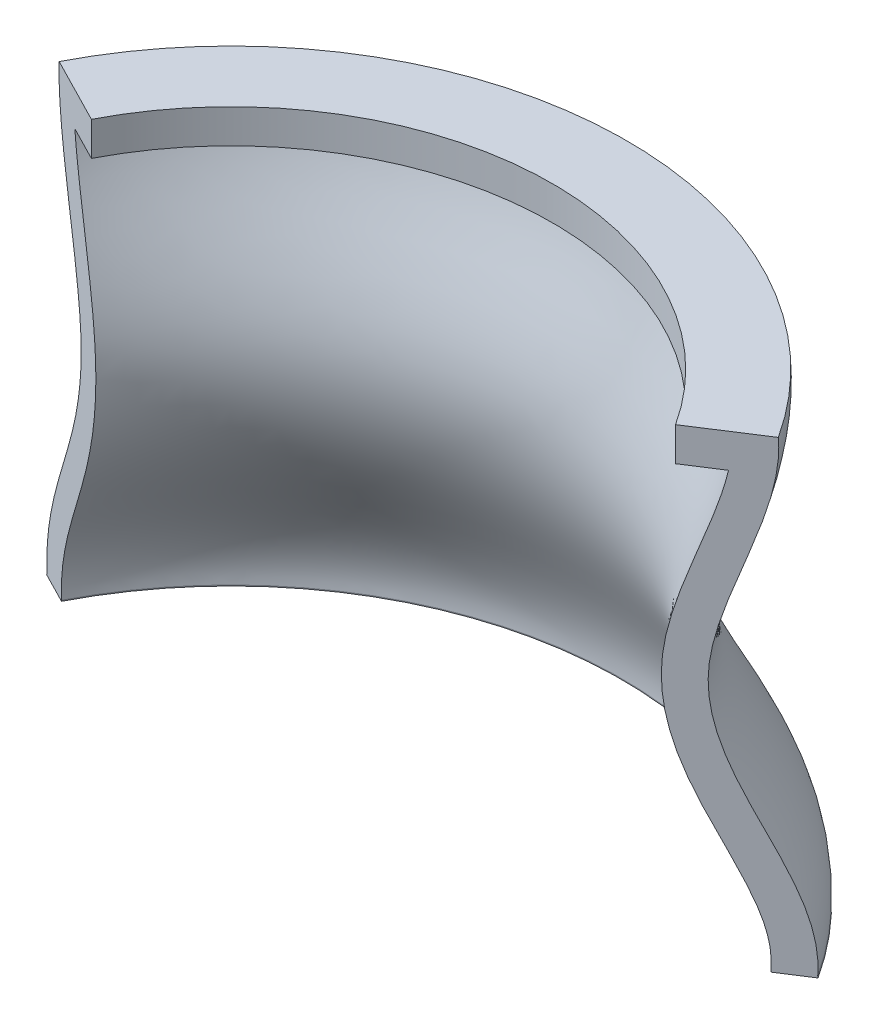
ISO-10303-21;
HEADER;
FILE_DESCRIPTION(('STEP AP214'),'2;1');
FILE_NAME('part.step','',(''),(''),'','','');
FILE_SCHEMA(('AUTOMOTIVE_DESIGN { 1 0 10303 214 1 1 1 1 }'));
ENDSEC;
DATA;
#1=APPLICATION_CONTEXT('core data for automotive mechanical design processes');
#2=APPLICATION_PROTOCOL_DEFINITION('international standard','automotive_design',2000,#1);
#3=PRODUCT_CONTEXT('',#1,'mechanical');
#4=PRODUCT('Part','Part','',(#3));
#5=PRODUCT_RELATED_PRODUCT_CATEGORY('part','',(#4));
#6=PRODUCT_DEFINITION_FORMATION('','',#4);
#7=PRODUCT_DEFINITION_CONTEXT('part definition',#1,'design');
#8=PRODUCT_DEFINITION('design','',#6,#7);
#9=PRODUCT_DEFINITION_SHAPE('','',#8);
#10=(LENGTH_UNIT() NAMED_UNIT(*) SI_UNIT(.MILLI.,.METRE.));
#11=(NAMED_UNIT(*) PLANE_ANGLE_UNIT() SI_UNIT($,.RADIAN.));
#12=(NAMED_UNIT(*) SI_UNIT($,.STERADIAN.) SOLID_ANGLE_UNIT());
#13=UNCERTAINTY_MEASURE_WITH_UNIT(LENGTH_MEASURE(1.E-05),#10,'distance_accuracy_value','');
#14=(GEOMETRIC_REPRESENTATION_CONTEXT(3) GLOBAL_UNCERTAINTY_ASSIGNED_CONTEXT((#13)) GLOBAL_UNIT_ASSIGNED_CONTEXT((#10,
#11,#12)) REPRESENTATION_CONTEXT('',''));
#15=CARTESIAN_POINT('',(0.,0.,0.));
#16=DIRECTION('',(0.,0.,1.));
#17=DIRECTION('',(1.,0.,0.));
#18=AXIS2_PLACEMENT_3D('',#15,#16,#17);
#19=CARTESIAN_POINT('',(0.745225859525673,-249.139394389774,8.26973830905769));
#20=DIRECTION('',(-0.542378393115804,0.,-0.840134321808792));
#21=DIRECTION('',(-0.840134321808792,0.,0.542378393115804));
#22=AXIS2_PLACEMENT_3D('',#19,#20,#21);
#23=PLANE('',#22);
#24=DIRECTION('',(-0.840134321808792,0.,0.542378393115804));
#25=VECTOR('',#24,1.);
#26=CARTESIAN_POINT('',(0.745225859525673,136.691433037476,8.26973830905769));
#27=LINE('',#26,#25);
#28=CARTESIAN_POINT('',(98.9977571909952,136.691433037479,-55.1606545219238));
#29=VERTEX_POINT('',#28);
#30=CARTESIAN_POINT('',(80.557523717464,136.691433037476,-43.2559103156399));
#31=VERTEX_POINT('',#30);
#32=EDGE_CURVE('E115',#29,#31,#27,.T.);
#33=ORIENTED_EDGE('',*,*,#32,.T.);
#34=DIRECTION('',(0.,1.,0.));
#35=VECTOR('',#34,1.);
#36=CARTESIAN_POINT('',(80.5575237174639,-0.309566962524016,-43.2559103156399));
#37=LINE('',#36,#35);
#38=CARTESIAN_POINT('',(80.557523717464,126.691433037476,-43.2559103156399));
#39=VERTEX_POINT('',#38);
#40=EDGE_CURVE('E101',#39,#31,#37,.T.);
#41=ORIENTED_EDGE('',*,*,#40,.F.);
#42=DIRECTION('',(-0.840134321808792,0.,0.542378393115804));
#43=VECTOR('',#42,1.);
#44=CARTESIAN_POINT('',(0.745225859525673,126.691433037476,8.26973830905769));
#45=LINE('',#44,#43);
#46=CARTESIAN_POINT('',(90.0632839932266,126.691433037476,-49.3926896970751));
#47=VERTEX_POINT('',#46);
#48=EDGE_CURVE('E214',#47,#39,#45,.T.);
#49=ORIENTED_EDGE('',*,*,#48,.F.);
#50=CARTESIAN_POINT('',(97.6500739454705,-0.00626043381479245,-54.2906099895659));
#51=CARTESIAN_POINT('',(97.6529723465695,0.050992226669759,-54.2924811547948));
#52=CARTESIAN_POINT('',(97.6558692963534,0.108244968614973,-54.2943513830761));
#53=CARTESIAN_POINT('',(97.6616631850123,0.222750236839855,-54.298091832596));
#54=CARTESIAN_POINT('',(97.6645601238873,0.280002763119524,-54.2999620538347));
#55=CARTESIAN_POINT('',(97.6703571898607,0.394513294641576,-54.3037045545822));
#56=CARTESIAN_POINT('',(97.6732573172451,0.451771299867904,-54.3055768342758));
#57=CARTESIAN_POINT('',(97.6790459707793,0.566288177798032,-54.309313904076));
#58=CARTESIAN_POINT('',(97.6819344968852,0.623547050504287,-54.3111786941544));
#59=CARTESIAN_POINT('',(97.6906665943295,0.795343624830428,-54.3168160081618));
#60=CARTESIAN_POINT('',(97.6965755200439,0.909877658183604,-54.3206307239171));
#61=CARTESIAN_POINT('',(97.7043319736219,1.08174848521094,-54.3256381765574));
#62=CARTESIAN_POINT('',(97.7067329204786,1.13904888515215,-54.3271881926254));
#63=CARTESIAN_POINT('',(97.7112219706133,1.25366709113484,-54.3300862575365));
#64=CARTESIAN_POINT('',(97.7133100716362,1.31098489729882,-54.3314343049238));
#65=CARTESIAN_POINT('',(97.7190695275018,1.48246612137103,-54.3351525251375));
#66=CARTESIAN_POINT('',(97.7222583166751,1.59665313448834,-54.3372111606473));
#67=CARTESIAN_POINT('',(97.7273647344901,1.82507091288732,-54.3405077890758));
#68=CARTESIAN_POINT('',(97.7292823176255,1.93930167958881,-54.3417457526164));
#69=CARTESIAN_POINT('',(97.7318536076438,2.16777237667633,-54.3434057397306));
#70=CARTESIAN_POINT('',(97.7325074390331,2.28201230505061,-54.3438278436836));
#71=CARTESIAN_POINT('',(97.7325643268168,2.51049013772023,-54.3438645696022));
#72=CARTESIAN_POINT('',(97.731967401428,2.62472804202081,-54.3434792033282));
#73=CARTESIAN_POINT('',(97.7283276769775,2.96666220947244,-54.341129450619));
#74=CARTESIAN_POINT('',(97.7234442348151,3.19433449227308,-54.3379767720006));
#75=CARTESIAN_POINT('',(97.7088778089557,3.64946836089107,-54.32857290116));
#76=CARTESIAN_POINT('',(97.6991945845693,3.87692993556913,-54.3223215535522));
#77=CARTESIAN_POINT('',(97.6751853534089,4.33114243440764,-54.3068215461383));
#78=CARTESIAN_POINT('',(97.6608667653355,4.55789391342217,-54.2975776757364));
#79=CARTESIAN_POINT('',(97.6277352402899,5.01092117793659,-54.2761884492172));
#80=CARTESIAN_POINT('',(97.6089223926932,5.23719697280594,-54.2640431507994));
#81=CARTESIAN_POINT('',(97.5459938520619,5.9150402196691,-54.2234174081501));
#82=CARTESIAN_POINT('',(97.4953800753674,6.36577270591949,-54.1907418964367));
#83=CARTESIAN_POINT('',(97.3797810627051,7.25220800335587,-54.116112869737));
#84=CARTESIAN_POINT('',(97.3152173044396,7.6879898918938,-54.0744314545721));
#85=CARTESIAN_POINT('',(97.1722500190924,8.5566792729806,-53.9821338725286));
#86=CARTESIAN_POINT('',(97.0938353224117,8.98958415089695,-53.9315104947207));
#87=CARTESIAN_POINT('',(96.9244351818875,9.852253721158,-53.8221482491534));
#88=CARTESIAN_POINT('',(96.8334393904096,10.2820155188637,-53.7634027011132));
#89=CARTESIAN_POINT('',(96.640129549994,11.1381414190644,-53.6386047040591));
#90=CARTESIAN_POINT('',(96.5378097072509,11.5645036615132,-53.5725485146496));
#91=CARTESIAN_POINT('',(96.3230767363544,12.4135515504553,-53.4339200588413));
#92=CARTESIAN_POINT('',(96.2106644962917,12.8362375168629,-53.361348365781));
#93=CARTESIAN_POINT('',(95.8630792581119,14.0876348747868,-53.1369524352007));
#94=CARTESIAN_POINT('',(95.6148840211636,14.9112397207704,-52.9767212313318));
#95=CARTESIAN_POINT('',(95.090987587738,16.5455660869207,-52.6385013796435));
#96=CARTESIAN_POINT('',(94.8152927904313,17.3562905536938,-52.4605168630347));
#97=CARTESIAN_POINT('',(94.2423487814763,18.9673154003877,-52.0906326161284));
#98=CARTESIAN_POINT('',(93.9450883068052,19.7676100720405,-51.8987256145887));
#99=CARTESIAN_POINT('',(93.3341790322162,21.3597148657106,-51.5043315491519));
#100=CARTESIAN_POINT('',(93.0205220896604,22.1515205322271,-51.3018392284873));
#101=CARTESIAN_POINT('',(92.3813672501433,23.7282794978847,-50.8892102407046));
#102=CARTESIAN_POINT('',(92.0558695780595,24.5132329268119,-50.6790737187641));
#103=CARTESIAN_POINT('',(91.3909274871383,26.0923529868729,-50.2497968597823));
#104=CARTESIAN_POINT('',(91.0513376472443,26.8864324727524,-50.0305626410402));
#105=CARTESIAN_POINT('',(90.3675736912737,28.4711786967947,-49.5891346621054));
#106=CARTESIAN_POINT('',(90.0234024348371,29.261847190237,-49.3669427480543));
#107=CARTESIAN_POINT('',(89.3335771200953,30.8419329181993,-48.9216016448188));
#108=CARTESIAN_POINT('',(88.9879235871686,31.6313504789219,-48.6984527948112));
#109=CARTESIAN_POINT('',(88.2979951727613,33.2109465539751,-48.2530451319443));
#110=CARTESIAN_POINT('',(87.9537201629274,34.0011249885429,-48.0307862362219));
#111=CARTESIAN_POINT('',(87.2692387332724,35.5841447914238,-47.588895066802));
#112=CARTESIAN_POINT('',(86.929032990209,36.3769865753486,-47.3692632300093));
#113=CARTESIAN_POINT('',(86.1722517806457,38.1630869045638,-46.8806963833419));
#114=CARTESIAN_POINT('',(85.7575650885196,39.1574852391578,-46.612980738494));
#115=CARTESIAN_POINT('',(84.9438213426653,41.1555167620316,-46.0876397140561));
#116=CARTESIAN_POINT('',(84.5447664663298,42.1591512129569,-45.8300157401589));
#117=CARTESIAN_POINT('',(83.7674331824598,44.1777891928056,-45.3281807758246));
#118=CARTESIAN_POINT('',(83.389154384336,45.1927925075625,-45.083969533229));
#119=CARTESIAN_POINT('',(82.6583912852814,47.2362332810939,-44.6121995970119));
#120=CARTESIAN_POINT('',(82.3059133322319,48.2646739730584,-44.3846450014894));
#121=CARTESIAN_POINT('',(81.635643476377,50.3247991014784,-43.9519286156264));
#122=CARTESIAN_POINT('',(81.317519080651,51.3563294898614,-43.7465521727342));
#123=CARTESIAN_POINT('',(80.7166264329103,53.4340871100825,-43.3586246946435));
#124=CARTESIAN_POINT('',(80.4338620153338,54.4803159221588,-43.1760761349021));
#125=CARTESIAN_POINT('',(79.9086897669904,56.5868526967909,-42.8370326358195));
#126=CARTESIAN_POINT('',(79.6662732549411,57.6471575775802,-42.6805320919696));
#127=CARTESIAN_POINT('',(79.2263613585989,59.7811407733943,-42.3965314253417));
#128=CARTESIAN_POINT('',(79.0288709659511,60.8548205605112,-42.2690345250967));
#129=CARTESIAN_POINT('',(78.737994625523,62.6706517182577,-42.0812490269669));
#130=CARTESIAN_POINT('',(78.6314629487749,63.4098434381794,-42.0124737393127));
#131=CARTESIAN_POINT('',(78.4424801657721,64.8927490330594,-41.890469227045));
#132=CARTESIAN_POINT('',(78.3600336358989,65.6364637400547,-41.8372429568763));
#133=CARTESIAN_POINT('',(78.2202989084025,67.1270997214922,-41.7470322667586));
#134=CARTESIAN_POINT('',(78.163005850192,67.8740203482378,-41.7100447088857));
#135=CARTESIAN_POINT('',(78.0744121230822,69.3697373198263,-41.6528498983624));
#136=CARTESIAN_POINT('',(78.0431007334387,70.118532763013,-41.6326357245568));
#137=CARTESIAN_POINT('',(78.0070713654121,71.6166785404882,-41.6093756931214));
#138=CARTESIAN_POINT('',(78.0023397188302,72.3660283913619,-41.6063210115029));
#139=CARTESIAN_POINT('',(78.015470087199,73.4908633669651,-41.614797784695));
#140=CARTESIAN_POINT('',(78.0232471753082,73.8665506169505,-41.6198185586859));
#141=CARTESIAN_POINT('',(78.0456050791866,74.6176434464617,-41.6342524934321));
#142=CARTESIAN_POINT('',(78.060185869957,74.9930490270174,-41.6436656380486));
#143=CARTESIAN_POINT('',(78.0961801576338,75.7434476174287,-41.6669030221247));
#144=CARTESIAN_POINT('',(78.1175946178443,76.1184405616346,-41.6807278834796));
#145=CARTESIAN_POINT('',(78.1672067568217,76.8677892804022,-41.7127567525772));
#146=CARTESIAN_POINT('',(78.1954044470656,77.2421450538847,-41.7309607677293));
#147=CARTESIAN_POINT('',(78.2582503897009,77.9902309606631,-41.7715331863242));
#148=CARTESIAN_POINT('',(78.2929010985036,78.3639608008456,-41.7939031755901));
#149=CARTESIAN_POINT('',(78.3683332991725,79.110537496885,-41.842601097727));
#150=CARTESIAN_POINT('',(78.4091148043398,79.4833843508242,-41.868929039185));
#151=CARTESIAN_POINT('',(78.5402031883033,80.6006927925859,-41.9535577767626));
#152=CARTESIAN_POINT('',(78.6392368362119,81.3437226337301,-42.0174924469966));
#153=CARTESIAN_POINT('',(78.8580432814978,82.8252418760472,-42.1587506781114));
#154=CARTESIAN_POINT('',(78.977812214926,83.5637320966601,-42.2360717444834));
#155=CARTESIAN_POINT('',(79.2652319618521,85.2047342876377,-42.4216257165577));
#156=CARTESIAN_POINT('',(79.4375670066023,86.1060821560101,-42.5328826932371));
#157=CARTESIAN_POINT('',(79.805673624607,87.9015715335771,-42.7705269255771));
#158=CARTESIAN_POINT('',(80.0014369523751,88.795715460608,-42.8969088580725));
#159=CARTESIAN_POINT('',(80.4125371665499,90.5775544122617,-43.1623091253698));
#160=CARTESIAN_POINT('',(80.627873763162,91.4652495321532,-43.3013272730845));
#161=CARTESIAN_POINT('',(81.0744808647508,93.2348507231825,-43.5896502659987));
#162=CARTESIAN_POINT('',(81.3057503919158,94.1167571459437,-43.7389544799372));
#163=CARTESIAN_POINT('',(81.7813645691623,95.8776102287981,-44.0460040153528));
#164=CARTESIAN_POINT('',(82.0257360244444,96.7565465810112,-44.2037666418741));
#165=CARTESIAN_POINT('',(82.5238805215691,98.5105179509239,-44.5253614212759));
#166=CARTESIAN_POINT('',(82.777652590643,99.3855533618499,-44.6891929461512));
#167=CARTESIAN_POINT('',(83.2915945894062,101.133031222346,-45.0209863608563));
#168=CARTESIAN_POINT('',(83.5517650678698,102.005473442262,-45.1889486049667));
#169=CARTESIAN_POINT('',(84.0755546977968,103.749049561602,-45.5270995058833));
#170=CARTESIAN_POINT('',(84.3391744228889,104.620183215843,-45.6972885330156));
#171=CARTESIAN_POINT('',(84.8668540072619,106.362276790706,-46.0379507314556));
#172=CARTESIAN_POINT('',(85.1309138736253,107.233236708273,-46.2084239073355));
#173=CARTESIAN_POINT('',(85.6564009011121,108.976216936723,-46.5476706232153));
#174=CARTESIAN_POINT('',(85.9178282462333,109.848237168653,-46.7164442820013));
#175=CARTESIAN_POINT('',(86.43476583322,111.594485503086,-47.0501716045173));
#176=CARTESIAN_POINT('',(86.6902777716165,112.468712890765,-47.2151263635027));
#177=CARTESIAN_POINT('',(87.1918419304453,114.220636915393,-47.5389288263331));
#178=CARTESIAN_POINT('',(87.437897885186,115.098332028682,-47.6977789409928));
#179=CARTESIAN_POINT('',(87.9161316944769,116.856828440095,-48.0065196724254));
#180=CARTESIAN_POINT('',(88.1483405639575,117.737617727538,-48.1564303119823));
#181=CARTESIAN_POINT('',(88.5949729196666,119.505755367552,-48.4447696085861));
#182=CARTESIAN_POINT('',(88.809394194446,120.393104520788,-48.5831968379538));
#183=CARTESIAN_POINT('',(89.1136266420929,121.730199393826,-48.7796048429656));
#184=CARTESIAN_POINT('',(89.2121817516245,122.177130948856,-48.8432305758437));
#185=CARTESIAN_POINT('',(89.4026348533489,123.072989573305,-48.966184304308));
#186=CARTESIAN_POINT('',(89.494533079451,123.521916572018,-49.0255124509026));
#187=CARTESIAN_POINT('',(89.6710167110061,124.422983296087,-49.1394476943622));
#188=CARTESIAN_POINT('',(89.7555834819998,124.875128219444,-49.1940427610937));
#189=CARTESIAN_POINT('',(89.9161327983945,125.781627365753,-49.2976910444474));
#190=CARTESIAN_POINT('',(89.9921142555959,126.235981861175,-49.3467435585439));
#191=CARTESIAN_POINT('',(90.0632839932266,126.691433037476,-49.3926896970751));
#192=B_SPLINE_CURVE_WITH_KNOTS('',3,(#50,#51,#52,#53,#54,#55,#56,#57,#58,#59,#60,#61,#62,#63,
#64,#65,#66,#67,#68,#69,#70,#71,#72,#73,#74,#75,#76,#77,#78,#79,#80,#81,#82,#83,#84,#85,#86,#87,
#88,#89,#90,#91,#92,#93,#94,#95,#96,#97,#98,#99,#100,#101,#102,#103,#104,#105,#106,#107,#108,
#109,#110,#111,#112,#113,#114,#115,#116,#117,#118,#119,#120,#121,#122,#123,#124,#125,#126,#127,
#128,#129,#130,#131,#132,#133,#134,#135,#136,#137,#138,#139,#140,#141,#142,#143,#144,#145,#146,
#147,#148,#149,#150,#151,#152,#153,#154,#155,#156,#157,#158,#159,#160,#161,#162,#163,#164,#165,
#166,#167,#168,#169,#170,#171,#172,#173,#174,#175,#176,#177,#178,#179,#180,#181,#182,#183,#184,
#185,#186,#187,#188,#189,#190,#191),.UNSPECIFIED.,.F.,.F.,(4,2,2,2,2,2,2,2,2,2,2,2,2,2,2,2,2,2,
2,2,2,2,2,2,2,2,2,2,2,2,2,2,2,2,2,2,2,2,2,2,2,2,2,2,2,2,2,2,2,2,2,2,2,2,2,2,2,2,2,2,2,2,2,2,2,2,
2,2,2,2,4),(0.,0.172069481748386,0.344138315328275,0.516224105252337,0.688310543451353,
1.032554416554,1.20466731631694,1.37678145665585,1.71952035976686,2.06227153147332,
2.40498893317287,2.74770134337536,3.43085995597681,4.11405282966193,4.79615764380616,
5.47824889434355,6.84198338198694,8.16917219964607,9.49743620900451,10.8267992539083,
12.1568456224069,13.4867750666083,16.1107265684423,18.7340688927741,21.3587913022965,
23.9848297905993,26.6108184315594,29.283889286879,31.9553633576754,34.6259580705434,
37.296298057951,39.9670761403357,43.2974339779905,46.6282540713645,49.9590115240326,
53.290585720386,56.5863023345853,59.8823760271535,63.1777396149427,66.4734691649189,
68.722933602427,70.9728251796131,73.2222818024005,75.4708097758979,77.7181813746851,
78.8455133715751,79.9728412263349,81.1003280644552,82.2278168102524,83.3557356273726,
84.4836568916161,86.7401010135971,88.9961251066847,91.7687517406593,94.540405414172,
97.3120180582761,100.083460758406,102.860807648258,105.637867938718,108.415167246603,
111.192934458445,113.970746808263,116.748363638542,119.525173727946,122.300875702505,
125.070107071223,127.83968221126,129.225834551546,130.611938161613,132.001467433958,
133.39117263381),.UNSPECIFIED.);
#193=CARTESIAN_POINT('',(97.6500739454705,-0.00626043381479245,-54.2906099895659));
#194=VERTEX_POINT('',#193);
#195=EDGE_CURVE('E206',#194,#47,#192,.T.);
#196=ORIENTED_EDGE('',*,*,#195,.F.);
#197=CARTESIAN_POINT('',(0.422385769287787,-13.3893943897737,8.4781591351496));
#198=DIRECTION('',(-0.542378393115804,0.,-0.840134321808792));
#199=DIRECTION('',(-0.840134321808792,0.,0.542378393115804));
#200=AXIS2_PLACEMENT_3D('',#197,#198,#199);
#201=CIRCLE('',#200,116.5);
#202=CARTESIAN_POINT('',(97.6791084914496,-0.308566962524024,-54.3093542665036));
#203=VERTEX_POINT('',#202);
#204=EDGE_CURVE('E212',#203,#194,#201,.F.);
#205=ORIENTED_EDGE('',*,*,#204,.F.);
#206=DIRECTION('',(0.840134321808792,0.,-0.542378393115804));
#207=VECTOR('',#206,1.);
#208=CARTESIAN_POINT('',(0.745225859525659,-0.308566962524031,8.2697383090577));
#209=LINE('',#208,#207);
#210=CARTESIAN_POINT('',(106.129653796851,-0.308566962524023,-59.7649023434171));
#211=VERTEX_POINT('',#210);
#212=EDGE_CURVE('E121',#203,#211,#209,.T.);
#213=ORIENTED_EDGE('',*,*,#212,.T.);
#214=CARTESIAN_POINT('',(0.422385769287787,-13.3893943897737,8.4781591351496));
#215=DIRECTION('',(-0.542378393115804,0.,-0.840134321808792));
#216=DIRECTION('',(-0.840134321808792,0.,0.542378393115804));
#217=AXIS2_PLACEMENT_3D('',#214,#215,#216);
#218=CIRCLE('',#217,126.5);
#219=CARTESIAN_POINT('',(106.079685655918,0.251403416725651,-59.7326436446801));
#220=VERTEX_POINT('',#219);
#221=EDGE_CURVE('E145',#211,#220,#218,.F.);
#222=ORIENTED_EDGE('',*,*,#221,.T.);
#223=CARTESIAN_POINT('',(106.079685655918,0.251403416725651,-59.7326436446801));
#224=CARTESIAN_POINT('',(107.382812457229,26.0009316272872,-60.5739231903123));
#225=CARTESIAN_POINT('',(69.2176983011643,62.0053854720913,-35.9350853858046));
#226=CARTESIAN_POINT('',(100.39909294893,117.34806292094,-56.0653363291946));
#227=CARTESIAN_POINT('',(98.9701417174655,137.101403416726,-55.1428263773411));
#228=B_SPLINE_CURVE_WITH_KNOTS('',3,(#223,#224,#225,#226,#227),.UNSPECIFIED.,.F.,.F.,(4,1,4),
(0.,0.593387476514039,1.),.UNSPECIFIED.);
#229=EDGE_CURVE('E120',#220,#29,#228,.T.);
#230=ORIENTED_EDGE('',*,*,#229,.T.);
#231=EDGE_LOOP('',(#33,#41,#49,#196,#205,#213,#222,#230));
#232=FACE_BOUND('',#231,.T.);
#233=ADVANCED_FACE('F38',(#232),#23,.F.);
#234=CARTESIAN_POINT('',(-111.470105782793,-249.139394389774,-49.2880256775196));
#235=DIRECTION('',(0.456388468719719,0.,-0.889780627806467));
#236=DIRECTION('',(-0.889780627806467,0.,-0.456388468719719));
#237=AXIS2_PLACEMENT_3D('',#234,#235,#236);
#238=PLANE('',#237);
#239=DIRECTION('',(-0.889780627806467,0.,-0.456388468719719));
#240=VECTOR('',#239,1.);
#241=CARTESIAN_POINT('',(-111.470105782793,126.691433037476,-49.2880256775196));
#242=LINE('',#241,#240);
#243=CARTESIAN_POINT('',(-83.7834437249025,126.691433037476,-35.086914857978));
#244=VERTEX_POINT('',#243);
#245=CARTESIAN_POINT('',(-93.8509307045257,126.691433037476,-40.250755048355));
#246=VERTEX_POINT('',#245);
#247=EDGE_CURVE('E126',#244,#246,#242,.T.);
#248=ORIENTED_EDGE('',*,*,#247,.F.);
#249=DIRECTION('',(0.,1.,0.));
#250=VECTOR('',#249,1.);
#251=CARTESIAN_POINT('',(-83.7834437249025,-0.309566962524016,-35.086914857978));
#252=LINE('',#251,#250);
#253=CARTESIAN_POINT('',(-83.7834437249025,136.691433037476,-35.086914857978));
#254=VERTEX_POINT('',#253);
#255=EDGE_CURVE('E53',#254,#244,#252,.F.);
#256=ORIENTED_EDGE('',*,*,#255,.F.);
#257=DIRECTION('',(-0.889780627806467,0.,-0.456388468719719));
#258=VECTOR('',#257,1.);
#259=CARTESIAN_POINT('',(-111.470105782793,136.691433037476,-49.2880256775196));
#260=LINE('',#259,#258);
#261=CARTESIAN_POINT('',(-103.313371369864,136.691433037476,-45.1042533946284));
#262=VERTEX_POINT('',#261);
#263=EDGE_CURVE('E11',#254,#262,#260,.T.);
#264=ORIENTED_EDGE('',*,*,#263,.T.);
#265=CARTESIAN_POINT('',(-110.813794328453,0.251403416719608,-48.9513887916552));
#266=CARTESIAN_POINT('',(-112.193927187311,26.000931627281,-49.659289933127));
#267=CARTESIAN_POINT('',(-71.7735106508517,62.0053854720874,-28.9267504378969));
#268=CARTESIAN_POINT('',(-104.797516676268,117.348062920934,-45.8655048565964));
#269=CARTESIAN_POINT('',(-103.284124006988,137.10140341672,-45.0892517653063));
#270=B_SPLINE_CURVE_WITH_KNOTS('',3,(#265,#266,#267,#268,#269),.UNSPECIFIED.,.F.,.F.,(4,1,4),
(0.,0.593387476514039,1.),.UNSPECIFIED.);
#271=CARTESIAN_POINT('',(-110.813794328453,0.251403416719608,-48.9513887916552));
#272=VERTEX_POINT('',#271);
#273=EDGE_CURVE('E132',#262,#272,#270,.F.);
#274=ORIENTED_EDGE('',*,*,#273,.T.);
#275=CARTESIAN_POINT('',(1.08714363472618,-13.3893943897737,8.44511561552255));
#276=DIRECTION('',(0.456388468719719,0.,-0.889780627806467));
#277=DIRECTION('',(-0.889780627806467,0.,-0.456388468719719));
#278=AXIS2_PLACEMENT_3D('',#275,#276,#277);
#279=CIRCLE('',#278,126.5);
#280=CARTESIAN_POINT('',(-110.866715251518,-0.308566962524001,-48.9785331217139));
#281=VERTEX_POINT('',#280);
#282=EDGE_CURVE('E136',#272,#281,#279,.F.);
#283=ORIENTED_EDGE('',*,*,#282,.T.);
#284=DIRECTION('',(0.889780627806467,0.,0.456388468719719));
#285=VECTOR('',#284,1.);
#286=CARTESIAN_POINT('',(-111.470105782793,-0.308566962523999,-49.2880256775196));
#287=LINE('',#286,#285);
#288=CARTESIAN_POINT('',(-101.916799350737,-0.308566962524,-44.3879202386262));
#289=VERTEX_POINT('',#288);
#290=EDGE_CURVE('E46',#281,#289,#287,.T.);
#291=ORIENTED_EDGE('',*,*,#290,.T.);
#292=CARTESIAN_POINT('',(1.08714363472618,-13.3893943897737,8.44511561552255));
#293=DIRECTION('',(0.456388468719719,0.,-0.889780627806467));
#294=DIRECTION('',(-0.889780627806467,0.,-0.456388468719719));
#295=AXIS2_PLACEMENT_3D('',#292,#293,#294);
#296=CIRCLE('',#295,116.5);
#297=CARTESIAN_POINT('',(-101.88604907965,-0.00626043382030513,-44.3721477339262));
#298=VERTEX_POINT('',#297);
#299=EDGE_CURVE('E61',#298,#289,#296,.F.);
#300=ORIENTED_EDGE('',*,*,#299,.F.);
#301=CARTESIAN_POINT('',(-93.8509307045257,126.691433037476,-40.250755048355));
#302=CARTESIAN_POINT('',(-93.7668854227947,126.183648215492,-40.207646335675));
#303=CARTESIAN_POINT('',(-93.6765189003933,125.677232048323,-40.1612953166784));
#304=CARTESIAN_POINT('',(-93.4846413228614,124.667154406378,-40.0628769975391));
#305=CARTESIAN_POINT('',(-93.3831321191838,124.163492488516,-40.0108106470482));
#306=CARTESIAN_POINT('',(-93.1707359789729,123.160178658433,-39.9018678962582));
#307=CARTESIAN_POINT('',(-93.059876091351,122.660519467452,-39.8450053699534));
#308=CARTESIAN_POINT('',(-92.8297741585983,121.663629731152,-39.7269809204918));
#309=CARTESIAN_POINT('',(-92.7105317269779,121.166399298946,-39.6658187990959));
#310=CARTESIAN_POINT('',(-92.3422068298699,119.679147565428,-39.4768966866906));
#311=CARTESIAN_POINT('',(-92.0822982226099,118.692510303434,-39.3435837244081));
#312=CARTESIAN_POINT('',(-91.5412778449906,116.726808119775,-39.0660822212606));
#313=CARTESIAN_POINT('',(-91.2601681168181,115.747742478769,-38.921894727879));
#314=CARTESIAN_POINT('',(-90.6772530075087,113.775833353922,-38.6229044758805));
#315=CARTESIAN_POINT('',(-90.375147408228,112.783102609551,-38.4679477286345));
#316=CARTESIAN_POINT('',(-89.7609780540985,110.801101852433,-38.1529264724887));
#317=CARTESIAN_POINT('',(-89.4489101870527,109.81183346082,-37.9928598543508));
#318=CARTESIAN_POINT('',(-88.8199613667477,107.834940992615,-37.6702578780527));
#319=CARTESIAN_POINT('',(-88.5030791408247,106.847317430176,-37.5077218671148));
#320=CARTESIAN_POINT('',(-87.8693267727348,104.872035745205,-37.1826560432689));
#321=CARTESIAN_POINT('',(-87.5524566311288,103.884377622463,-37.0201262306486));
#322=CARTESIAN_POINT('',(-86.8925204855549,101.810391018564,-36.6816301592363));
#323=CARTESIAN_POINT('',(-86.5499277747608,100.723871088137,-36.5059066631434));
#324=CARTESIAN_POINT('',(-85.8764342393989,98.546422786159,-36.1604567020062));
#325=CARTESIAN_POINT('',(-85.5455315992301,97.4554951287694,-35.9907293056992));
#326=CARTESIAN_POINT('',(-84.9016402691134,95.2667692703305,-35.6604629805059));
#327=CARTESIAN_POINT('',(-84.588654026171,94.1689701533899,-35.4999253067435));
#328=CARTESIAN_POINT('',(-83.9871715267013,91.9638988081433,-35.1914114233031));
#329=CARTESIAN_POINT('',(-83.698695029995,90.8566197139707,-35.0434453488809));
#330=CARTESIAN_POINT('',(-83.1575401816134,88.6468346813108,-34.7658748726591));
#331=CARTESIAN_POINT('',(-82.9044361715915,87.5444616286369,-34.6360521411332));
#332=CARTESIAN_POINT('',(-82.4373560211984,85.3292137425133,-34.3964762412479));
#333=CARTESIAN_POINT('',(-82.2233783145835,84.216339331314,-34.2867222695269));
#334=CARTESIAN_POINT('',(-81.843251275195,81.9813366078867,-34.0917465732666));
#335=CARTESIAN_POINT('',(-81.6770543966932,80.8592186458063,-34.0065004614554));
#336=CARTESIAN_POINT('',(-81.4013689863122,78.6068258680666,-33.8650952225008));
#337=CARTESIAN_POINT('',(-81.291837497706,77.4765578917823,-33.8089140618873));
#338=CARTESIAN_POINT('',(-81.1561408831128,75.4676705350852,-33.7393122204791));
#339=CARTESIAN_POINT('',(-81.1166945345797,74.5901771039809,-33.7190793023407));
#340=CARTESIAN_POINT('',(-81.0771593694951,72.833596787439,-33.6988008281981));
#341=CARTESIAN_POINT('',(-81.0770918937858,71.9545092961663,-33.6987662183913));
#342=CARTESIAN_POINT('',(-81.1157359160768,70.1971718781334,-33.7185876053797));
#343=CARTESIAN_POINT('',(-81.1544587198303,69.3189222702796,-33.7384494011497));
#344=CARTESIAN_POINT('',(-81.2696268241157,67.5656668403511,-33.797521708545));
#345=CARTESIAN_POINT('',(-81.3460681366561,66.690660685197,-33.8367301746399));
#346=CARTESIAN_POINT('',(-81.5356113128567,64.941634386963,-33.9339511269051));
#347=CARTESIAN_POINT('',(-81.6488795621368,64.0676371352678,-33.9920489559969));
#348=CARTESIAN_POINT('',(-81.9100769109271,62.3263549445044,-34.1260229427558));
#349=CARTESIAN_POINT('',(-82.0580015820516,61.4590691624613,-34.2018968290043));
#350=CARTESIAN_POINT('',(-82.3863378255807,59.7323048403488,-34.3703078628328));
#351=CARTESIAN_POINT('',(-82.5667504605452,58.8728265565996,-34.4628455554235));
#352=CARTESIAN_POINT('',(-82.9576144723881,57.1626983961283,-34.663328486011));
#353=CARTESIAN_POINT('',(-83.1680617107355,56.312047320381,-34.7712716012623));
#354=CARTESIAN_POINT('',(-83.5940822258011,54.7043065597516,-34.9897870919775));
#355=CARTESIAN_POINT('',(-83.8070542859123,53.9463415848269,-35.0990252450196));
#356=CARTESIAN_POINT('',(-84.2532783593845,52.438135445357,-35.327903594619));
#357=CARTESIAN_POINT('',(-84.4865272833383,51.6878931235924,-35.4475422065499));
#358=CARTESIAN_POINT('',(-84.9713463079043,50.19492616415,-35.6962167734185));
#359=CARTESIAN_POINT('',(-85.2229168331706,49.4522017011743,-35.8252529461708));
#360=CARTESIAN_POINT('',(-85.7423629103969,47.9740327459962,-36.0916885060821));
#361=CARTESIAN_POINT('',(-86.0102380190993,47.2385880565168,-36.2290876658842));
#362=CARTESIAN_POINT('',(-86.5609729733764,45.7727103518445,-36.5115719935916));
#363=CARTESIAN_POINT('',(-86.8438679885412,45.0422940706801,-36.6566752007695));
#364=CARTESIAN_POINT('',(-87.4220133323205,43.5877394008821,-36.9532189328974));
#365=CARTESIAN_POINT('',(-87.7172628287023,42.8636005933346,-37.1046590309766));
#366=CARTESIAN_POINT('',(-88.31813650737,41.4208123326336,-37.4128606365535));
#367=CARTESIAN_POINT('',(-88.6237604792345,40.7021627685057,-37.5696220361213));
#368=CARTESIAN_POINT('',(-89.2433660460799,39.2695454635641,-37.8874316478679));
#369=CARTESIAN_POINT('',(-89.5573466528076,38.5555771814804,-38.0484793531493));
#370=CARTESIAN_POINT('',(-90.2271460177557,37.0516847596047,-38.3920344913093));
#371=CARTESIAN_POINT('',(-90.5837199110273,36.262186475866,-38.574929249916));
#372=CARTESIAN_POINT('',(-91.3019737000096,34.6862219730195,-38.9433377504629));
#373=CARTESIAN_POINT('',(-91.66365317143,33.8997555087925,-39.1288512747748));
#374=CARTESIAN_POINT('',(-92.3893307542927,32.3280589014186,-39.5010676059434));
#375=CARTESIAN_POINT('',(-92.7533291399005,31.5428289186814,-39.6877705534255));
#376=CARTESIAN_POINT('',(-93.4806969755983,29.9717168866826,-40.0608538532367));
#377=CARTESIAN_POINT('',(-93.844066218214,29.1858347156918,-40.2472340991475));
#378=CARTESIAN_POINT('',(-94.5670049179558,27.6113978666685,-40.6180455956472));
#379=CARTESIAN_POINT('',(-94.9265725453805,26.822842123261,-40.8024759077412));
#380=CARTESIAN_POINT('',(-95.6336712968997,25.251436297375,-41.165162739028));
#381=CARTESIAN_POINT('',(-95.9812971577375,24.4686402922999,-41.3434678508242));
#382=CARTESIAN_POINT('',(-96.6653368455754,22.8968724594342,-41.6943271704359));
#383=CARTESIAN_POINT('',(-97.0017508618452,22.1079007361752,-41.8668814753321));
#384=CARTESIAN_POINT('',(-97.6588063833449,20.5220313958455,-42.2039000099571));
#385=CARTESIAN_POINT('',(-97.9794540226771,19.7251370085996,-42.3683673860048));
#386=CARTESIAN_POINT('',(-98.5998099950646,18.1213799139909,-42.6865618976082));
#387=CARTESIAN_POINT('',(-98.8995252924991,17.3145206281986,-42.8402926053505));
#388=CARTESIAN_POINT('',(-99.4721016498099,15.6883192866224,-43.1339798792377));
#389=CARTESIAN_POINT('',(-99.744951559502,14.8689722094774,-43.2739307262029));
#390=CARTESIAN_POINT('',(-100.138222601588,13.5980135856646,-43.4756482766645));
#391=CARTESIAN_POINT('',(-100.270883452431,13.1511749262425,-43.5436930066613));
#392=CARTESIAN_POINT('',(-100.524885581602,12.2533957436668,-43.673976403671));
#393=CARTESIAN_POINT('',(-100.646226037425,11.8024549250714,-43.7362146488025));
#394=CARTESIAN_POINT('',(-100.876067611854,10.8967411232276,-43.8541055546318));
#395=CARTESIAN_POINT('',(-100.984576519697,10.4419706462207,-43.9097622106045));
#396=CARTESIAN_POINT('',(-101.187193612794,9.52884302336228,-44.0136890684896));
#397=CARTESIAN_POINT('',(-101.281315713385,9.07048979982594,-44.0619664078909));
#398=CARTESIAN_POINT('',(-101.453571216526,8.15044920968577,-44.1503201243581));
#399=CARTESIAN_POINT('',(-101.531719930681,7.68876547939773,-44.19040435509));
#400=CARTESIAN_POINT('',(-101.672259474527,6.75009481994273,-44.2624902436855));
#401=CARTESIAN_POINT('',(-101.734192642976,6.27301999209029,-44.2942571568191));
#402=CARTESIAN_POINT('',(-101.811921114829,5.55528992460127,-44.3341258358351));
#403=CARTESIAN_POINT('',(-101.835304868497,5.31565077245144,-44.3461198882972));
#404=CARTESIAN_POINT('',(-101.876803515843,4.83578577514736,-44.3674054765921));
#405=CARTESIAN_POINT('',(-101.894918305676,4.59555991852391,-44.3766969591603));
#406=CARTESIAN_POINT('',(-101.925707973809,4.11423079761152,-44.39248967149));
#407=CARTESIAN_POINT('',(-101.93837292939,3.87312673219672,-44.3989858116661));
#408=CARTESIAN_POINT('',(-101.958034114193,3.39063344656056,-44.4090704749471));
#409=CARTESIAN_POINT('',(-101.965030626038,3.1492442411571,-44.4126591430162));
#410=CARTESIAN_POINT('',(-101.971163890188,2.78661412027086,-44.4158050319534));
#411=CARTESIAN_POINT('',(-101.972479717608,2.66541535172501,-44.416479949391));
#412=CARTESIAN_POINT('',(-101.973626637344,2.42300596301584,-44.4170682302837));
#413=CARTESIAN_POINT('',(-101.973457704594,2.30179534268698,-44.4169815808819));
#414=CARTESIAN_POINT('',(-101.971619244647,2.05937668374339,-44.4160385934828));
#415=CARTESIAN_POINT('',(-101.969949568267,1.93816864658335,-44.4151821789658));
#416=CARTESIAN_POINT('',(-101.965095074461,1.69579526455638,-44.4126922000595));
#417=CARTESIAN_POINT('',(-101.961910318764,1.57462991815137,-44.4110586673321));
#418=CARTESIAN_POINT('',(-101.955979506249,1.39261366227889,-44.4080166203854));
#419=CARTESIAN_POINT('',(-101.953803134769,1.33173868499417,-44.4069003105715));
#420=CARTESIAN_POINT('',(-101.949061093415,1.21000844590573,-44.4044680110535));
#421=CARTESIAN_POINT('',(-101.946495427489,1.14915318390834,-44.4031520233744));
#422=CARTESIAN_POINT('',(-101.940985378922,1.0274605429255,-44.4003257957074));
#423=CARTESIAN_POINT('',(-101.938040973705,0.966623165223003,-44.3988155441393));
#424=CARTESIAN_POINT('',(-101.933306078764,0.875387887581738,-44.3963869101769));
#425=CARTESIAN_POINT('',(-101.931674723472,0.844979438269635,-44.3955501514074));
#426=CARTESIAN_POINT('',(-101.928413888954,0.784162408317322,-44.3938775961435));
#427=CARTESIAN_POINT('',(-101.926784409728,0.753753827677003,-44.3930417996503));
#428=CARTESIAN_POINT('',(-101.921896154223,0.662541127796806,-44.3905345036098));
#429=CARTESIAN_POINT('',(-101.918636862885,0.601737035140401,-44.3888627398782));
#430=CARTESIAN_POINT('',(-101.912118648472,0.480128867213208,-44.3855194013049));
#431=CARTESIAN_POINT('',(-101.908859725396,0.419324791942431,-44.383847826463));
#432=CARTESIAN_POINT('',(-101.902342175208,0.297723876793116,-44.3805048285857));
#433=CARTESIAN_POINT('',(-101.899083548107,0.236927036914017,-44.3788334055558));
#434=CARTESIAN_POINT('',(-101.89256629196,0.115333320870809,-44.3754905584986));
#435=CARTESIAN_POINT('',(-101.889307662914,0.0545364447067008,-44.3738191344712));
#436=CARTESIAN_POINT('',(-101.88604907965,-0.00626043382031076,-44.3721477339262));
#437=B_SPLINE_CURVE_WITH_KNOTS('',3,(#301,#302,#303,#304,#305,#306,#307,#308,#309,#310,#311,
#312,#313,#314,#315,#316,#317,#318,#319,#320,#321,#322,#323,#324,#325,#326,#327,#328,#329,#330,
#331,#332,#333,#334,#335,#336,#337,#338,#339,#340,#341,#342,#343,#344,#345,#346,#347,#348,#349,
#350,#351,#352,#353,#354,#355,#356,#357,#358,#359,#360,#361,#362,#363,#364,#365,#366,#367,#368,
#369,#370,#371,#372,#373,#374,#375,#376,#377,#378,#379,#380,#381,#382,#383,#384,#385,#386,#387,
#388,#389,#390,#391,#392,#393,#394,#395,#396,#397,#398,#399,#400,#401,#402,#403,#404,#405,#406,
#407,#408,#409,#410,#411,#412,#413,#414,#415,#416,#417,#418,#419,#420,#421,#422,#423,#424,#425,
#426,#427,#428,#429,#430,#431,#432,#433,#434,#435,#436),.UNSPECIFIED.,.F.,.F.,(4,2,2,2,2,2,2,2,
2,2,2,2,2,2,2,2,2,2,2,2,2,2,2,2,2,2,2,2,2,2,2,2,2,2,2,2,2,2,2,2,2,2,2,2,2,2,2,2,2,2,2,2,2,2,2,2,
2,2,2,2,2,2,2,2,2,2,2,4),(0.,1.54936788731865,3.09847872232435,4.64325275919567,
6.18809806691024,9.27453148990197,12.3606679926098,15.5081203221535,18.6568890887498,
21.8065052300722,24.9562068146958,28.4143392702747,31.8719322559092,35.3299963552619,
38.7908224115222,42.2055491263621,45.6201391182071,49.031319466673,52.4399100745965,
55.0746385021728,57.7107947835128,60.3477196183878,62.9843657099736,65.6330937820024,
68.2814835848751,70.9299600224088,73.5780718725289,75.9622633702982,78.3460922443393,
80.7299763878441,83.1137957518094,85.5034667908792,87.8929771133252,90.2824389991689,
92.6716195526091,95.3277293760711,97.9836197525001,100.639830188571,103.296793392257,
105.954981955089,108.579531867364,111.204037451544,113.827513726474,116.450112947525,
119.073796101541,120.486808529532,121.899923542834,123.312176289602,124.72305430113,
126.132573478727,127.578393349343,128.301560663743,129.024742229996,129.749235005383,
130.473691655926,130.837305619675,131.200925722081,131.56458197477,131.92822341238,
132.110994385515,132.293763505268,132.476543525074,132.567934466489,132.659325511305,
132.842068483846,133.024811347312,133.207532479464,133.390253720667),.UNSPECIFIED.);
#438=EDGE_CURVE('E199',#246,#298,#437,.T.);
#439=ORIENTED_EDGE('',*,*,#438,.F.);
#440=EDGE_LOOP('',(#248,#256,#264,#274,#283,#291,#300,#439));
#441=FACE_BOUND('',#440,.T.);
#442=ADVANCED_FACE('F155',(#441),#238,.F.);
#443=CARTESIAN_POINT('',(-126.139046133486,-0.308566962523983,-130.618568454018));
#444=DIRECTION('',(0.,1.,0.));
#445=DIRECTION('',(0.,0.,1.));
#446=AXIS2_PLACEMENT_3D('',#443,#444,#445);
#447=PLANE('',#446);
#448=CARTESIAN_POINT('',(0.745225859531159,-0.308566962523999,8.26973830905769));
#449=DIRECTION('',(0.,1.,0.));
#450=DIRECTION('',(0.,0.,1.));
#451=AXIS2_PLACEMENT_3D('',#448,#449,#450);
#452=CIRCLE('',#451,115.379029419039);
#453=EDGE_CURVE('E163',#289,#203,#452,.F.);
#454=ORIENTED_EDGE('',*,*,#453,.F.);
#455=ORIENTED_EDGE('',*,*,#290,.F.);
#456=CARTESIAN_POINT('',(0.745225859531159,-0.308566962523999,8.26973830905769));
#457=DIRECTION('',(0.,1.,0.));
#458=DIRECTION('',(0.,0.,1.));
#459=AXIS2_PLACEMENT_3D('',#456,#457,#458);
#460=CIRCLE('',#459,125.437593967628);
#461=EDGE_CURVE('E124',#281,#211,#460,.F.);
#462=ORIENTED_EDGE('',*,*,#461,.T.);
#463=ORIENTED_EDGE('',*,*,#212,.F.);
#464=EDGE_LOOP('',(#454,#455,#462,#463));
#465=FACE_BOUND('',#464,.T.);
#466=ADVANCED_FACE('F160',(#465),#447,.F.);
#467=CARTESIAN_POINT('',(0.745225859531159,-13.3893943897737,8.26973830905769));
#468=DIRECTION('',(0.,-1.,0.));
#469=DIRECTION('',(1.,0.,0.));
#470=AXIS2_PLACEMENT_3D('',#467,#468,#469);
#471=DEGENERATE_TOROIDAL_SURFACE('',#470,0.384271993016906,126.5,.F.);
#472=ORIENTED_EDGE('',*,*,#461,.F.);
#473=ORIENTED_EDGE('',*,*,#282,.F.);
#474=CARTESIAN_POINT('',(0.745225859530778,0.251403416722708,8.26973830905769));
#475=DIRECTION('',(0.,-1.,0.));
#476=DIRECTION('',(1.,0.,0.));
#477=AXIS2_PLACEMENT_3D('',#474,#475,#476);
#478=CIRCLE('',#477,125.378117596249);
#479=EDGE_CURVE('E150',#272,#220,#478,.T.);
#480=ORIENTED_EDGE('',*,*,#479,.T.);
#481=ORIENTED_EDGE('',*,*,#221,.F.);
#482=EDGE_LOOP('',(#472,#473,#480,#481));
#483=FACE_BOUND('',#482,.T.);
#484=ADVANCED_FACE('F40',(#483),#471,.F.);
#485=CARTESIAN_POINT('',(126.044924540941,-1.05042022615711,8.26973830905769));
#486=CARTESIAN_POINT('',(126.071064179221,-0.61647901186267,8.26973830905769));
#487=CARTESIAN_POINT('',(126.0972038175,-0.18253779756823,8.26973830905769));
#488=CARTESIAN_POINT('',(126.12334345578,0.25140341672621,8.26973830905769));
#489=CARTESIAN_POINT('',(127.674436855351,26.0009316272877,8.26973830905769));
#490=CARTESIAN_POINT('',(82.2470413004403,62.0053854720917,8.26973830905769));
#491=CARTESIAN_POINT('',(119.361814305587,117.348062920941,8.26973830905769));
#492=CARTESIAN_POINT('',(117.660953866523,137.101403416726,8.26973830905769));
#493=B_SPLINE_CURVE_WITH_KNOTS('',3,(#485,#486,#487,#488,#489,#490,#491,#492),.UNSPECIFIED.,.F.,
.F.,(4,3,1,4),(-0.01,0.,0.593387476514039,1.),.UNSPECIFIED.);
#494=CARTESIAN_POINT('',(0.745225859534131,-119.90856696252,8.26973830905769));
#495=DIRECTION('',(0.,-1.,0.));
#496=AXIS1_PLACEMENT('',#494,#495);
#497=SURFACE_OF_REVOLUTION('',#493,#496);
#498=CARTESIAN_POINT('',(0.745225859526972,136.691433037476,8.26973830905769));
#499=DIRECTION('',(0.,-1.,0.));
#500=DIRECTION('',(1.,0.,0.));
#501=AXIS2_PLACEMENT_3D('',#498,#499,#500);
#502=CIRCLE('',#501,116.948598314532);
#503=EDGE_CURVE('E122',#29,#262,#502,.F.);
#504=ORIENTED_EDGE('',*,*,#503,.F.);
#505=ORIENTED_EDGE('',*,*,#229,.F.);
#506=ORIENTED_EDGE('',*,*,#479,.F.);
#507=ORIENTED_EDGE('',*,*,#273,.F.);
#508=EDGE_LOOP('',(#504,#505,#506,#507));
#509=FACE_BOUND('',#508,.T.);
#510=ADVANCED_FACE('F168',(#509),#497,.F.);
#511=CARTESIAN_POINT('',(-123.884219776482,136.691433037476,-118.659472686764));
#512=DIRECTION('',(0.,-1.,0.));
#513=DIRECTION('',(0.,0.,-1.));
#514=AXIS2_PLACEMENT_3D('',#511,#512,#513);
#515=PLANE('',#514);
#516=ORIENTED_EDGE('',*,*,#263,.F.);
#517=CARTESIAN_POINT('',(0.745225859525673,136.691433037476,8.26973830905769));
#518=DIRECTION('',(0.,-1.,0.));
#519=DIRECTION('',(0.,0.,-1.));
#520=AXIS2_PLACEMENT_3D('',#517,#518,#519);
#521=CIRCLE('',#520,94.9994492381933);
#522=EDGE_CURVE('E104',#31,#254,#521,.F.);
#523=ORIENTED_EDGE('',*,*,#522,.F.);
#524=ORIENTED_EDGE('',*,*,#32,.F.);
#525=ORIENTED_EDGE('',*,*,#503,.T.);
#526=EDGE_LOOP('',(#516,#523,#524,#525));
#527=FACE_BOUND('',#526,.T.);
#528=ADVANCED_FACE('F113',(#527),#515,.F.);
#529=CARTESIAN_POINT('',(0.745225859531159,-13.3893943897737,8.26973830905769));
#530=DIRECTION('',(0.,-1.,0.));
#531=DIRECTION('',(1.,0.,0.));
#532=AXIS2_PLACEMENT_3D('',#529,#530,#531);
#533=DEGENERATE_TOROIDAL_SURFACE('',#532,0.384271993016906,116.5,.F.);
#534=ORIENTED_EDGE('',*,*,#453,.T.);
#535=ORIENTED_EDGE('',*,*,#204,.T.);
#536=CARTESIAN_POINT('',(0.745225859530785,-0.00626043381744823,8.26973830905769));
#537=DIRECTION('',(0.,-1.,0.));
#538=DIRECTION('',(1.,0.,0.));
#539=AXIS2_PLACEMENT_3D('',#536,#537,#538);
#540=CIRCLE('',#539,115.344470009637);
#541=EDGE_CURVE('E217',#298,#194,#540,.T.);
#542=ORIENTED_EDGE('',*,*,#541,.F.);
#543=ORIENTED_EDGE('',*,*,#299,.T.);
#544=EDGE_LOOP('',(#534,#535,#542,#543));
#545=FACE_BOUND('',#544,.T.);
#546=ADVANCED_FACE('F194',(#545),#533,.T.);
#547=CARTESIAN_POINT('',(126.044924540941,-1.05042022615711,8.26973830905769));
#548=CARTESIAN_POINT('',(126.071064179221,-0.61647901186267,8.26973830905769));
#549=CARTESIAN_POINT('',(126.0972038175,-0.18253779756823,8.26973830905769));
#550=CARTESIAN_POINT('',(127.674436855351,26.0009316272877,8.26973830905769));
#551=CARTESIAN_POINT('',(82.2470413004403,62.0053854720917,8.26973830905769));
#552=CARTESIAN_POINT('',(119.361814305587,117.348062920941,8.26973830905769));
#553=CARTESIAN_POINT('',(117.660953866523,137.101403416726,8.26973830905769));
#554=B_SPLINE_CURVE_WITH_KNOTS('',3,(#547,#548,#549,#550,#551,#552,#553),.UNSPECIFIED.,.F.,.F.,
(4,2,1,4),(-0.01,0.,0.593387476514039,1.),.UNSPECIFIED.);
#555=CARTESIAN_POINT('',(0.745225859534131,-119.90856696252,8.26973830905769));
#556=DIRECTION('',(0.,-1.,0.));
#557=AXIS1_PLACEMENT('',#555,#556);
#558=SURFACE_OF_REVOLUTION('',#554,#557);
#559=OFFSET_SURFACE('',#558,10.,.F.);
#560=CARTESIAN_POINT('',(0.745225859527251,126.691433037474,8.26973830905769));
#561=DIRECTION('',(0.,-1.,0.));
#562=DIRECTION('',(1.,0.,0.));
#563=AXIS2_PLACEMENT_3D('',#560,#561,#562);
#564=CIRCLE('',#563,106.314021240556);
#565=EDGE_CURVE('E177',#47,#246,#564,.F.);
#566=ORIENTED_EDGE('',*,*,#565,.T.);
#567=ORIENTED_EDGE('',*,*,#438,.T.);
#568=ORIENTED_EDGE('',*,*,#541,.T.);
#569=ORIENTED_EDGE('',*,*,#195,.T.);
#570=EDGE_LOOP('',(#566,#567,#568,#569));
#571=FACE_BOUND('',#570,.T.);
#572=ADVANCED_FACE('F189',(#571),#559,.T.);
#573=CARTESIAN_POINT('',(-123.884219776482,126.691433037476,-118.659472686764));
#574=DIRECTION('',(0.,-1.,0.));
#575=DIRECTION('',(0.,0.,-1.));
#576=AXIS2_PLACEMENT_3D('',#573,#574,#575);
#577=PLANE('',#576);
#578=CARTESIAN_POINT('',(0.745225859525673,126.691433037476,8.26973830905769));
#579=DIRECTION('',(0.,-1.,0.));
#580=DIRECTION('',(0.,0.,-1.));
#581=AXIS2_PLACEMENT_3D('',#578,#579,#580);
#582=CIRCLE('',#581,94.9994492381933);
#583=EDGE_CURVE('E105',#39,#244,#582,.F.);
#584=ORIENTED_EDGE('',*,*,#583,.T.);
#585=ORIENTED_EDGE('',*,*,#247,.T.);
#586=ORIENTED_EDGE('',*,*,#565,.F.);
#587=ORIENTED_EDGE('',*,*,#48,.T.);
#588=EDGE_LOOP('',(#584,#585,#586,#587));
#589=FACE_BOUND('',#588,.T.);
#590=ADVANCED_FACE('F193',(#589),#577,.T.);
#591=CARTESIAN_POINT('',(0.745225859525673,-0.309566962524016,8.26973830905769));
#592=DIRECTION('',(0.,1.,0.));
#593=DIRECTION('',(0.,0.,1.));
#594=AXIS2_PLACEMENT_3D('',#591,#592,#593);
#595=CYLINDRICAL_SURFACE('',#594,94.9994492381933);
#596=ORIENTED_EDGE('',*,*,#522,.T.);
#597=ORIENTED_EDGE('',*,*,#255,.T.);
#598=ORIENTED_EDGE('',*,*,#583,.F.);
#599=ORIENTED_EDGE('',*,*,#40,.T.);
#600=EDGE_LOOP('',(#596,#597,#598,#599));
#601=FACE_BOUND('',#600,.T.);
#602=ADVANCED_FACE('F103',(#601),#595,.F.);
#603=CLOSED_SHELL('',(#233,#442,#466,#484,#510,#528,#546,#572,#590,#602));
#604=MANIFOLD_SOLID_BREP('B2',#603);
#605=ADVANCED_BREP_SHAPE_REPRESENTATION('',(#18,#604),#14);
#606=SHAPE_DEFINITION_REPRESENTATION(#9,#605);
ENDSEC;
END-ISO-10303-21;
